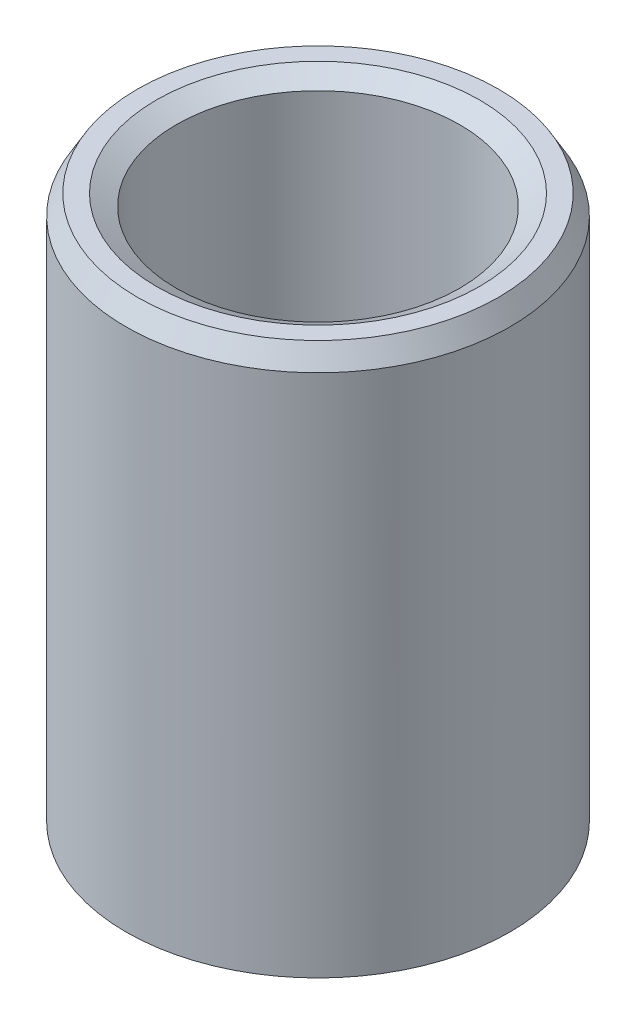
ISO-10303-21;
HEADER;
FILE_DESCRIPTION(('STEP AP214'),'2;1');
FILE_NAME('part.step','',(''),(''),'','','');
FILE_SCHEMA(('AUTOMOTIVE_DESIGN { 1 0 10303 214 1 1 1 1 }'));
ENDSEC;
DATA;
#1=APPLICATION_CONTEXT('core data for automotive mechanical design processes');
#2=APPLICATION_PROTOCOL_DEFINITION('international standard','automotive_design',2000,#1);
#3=PRODUCT_CONTEXT('',#1,'mechanical');
#4=PRODUCT('Part','Part','',(#3));
#5=PRODUCT_RELATED_PRODUCT_CATEGORY('part','',(#4));
#6=PRODUCT_DEFINITION_FORMATION('','',#4);
#7=PRODUCT_DEFINITION_CONTEXT('part definition',#1,'design');
#8=PRODUCT_DEFINITION('design','',#6,#7);
#9=PRODUCT_DEFINITION_SHAPE('','',#8);
#10=(LENGTH_UNIT() NAMED_UNIT(*) SI_UNIT(.MILLI.,.METRE.));
#11=(NAMED_UNIT(*) PLANE_ANGLE_UNIT() SI_UNIT($,.RADIAN.));
#12=(NAMED_UNIT(*) SI_UNIT($,.STERADIAN.) SOLID_ANGLE_UNIT());
#13=UNCERTAINTY_MEASURE_WITH_UNIT(LENGTH_MEASURE(1.E-05),#10,'distance_accuracy_value','');
#14=(GEOMETRIC_REPRESENTATION_CONTEXT(3) GLOBAL_UNCERTAINTY_ASSIGNED_CONTEXT((#13)) GLOBAL_UNIT_ASSIGNED_CONTEXT((#10,
#11,#12)) REPRESENTATION_CONTEXT('',''));
#15=CARTESIAN_POINT('',(0.,0.,0.));
#16=DIRECTION('',(0.,0.,1.));
#17=DIRECTION('',(1.,0.,0.));
#18=AXIS2_PLACEMENT_3D('',#15,#16,#17);
#19=CARTESIAN_POINT('',(0.,79.5900286234796,0.));
#20=DIRECTION('',(0.,-1.,0.));
#21=DIRECTION('',(0.,0.,-1.));
#22=AXIS2_PLACEMENT_3D('',#19,#20,#21);
#23=CYLINDRICAL_SURFACE('',#22,27.5);
#24=CARTESIAN_POINT('',(0.,1.64250513870305,0.));
#25=DIRECTION('',(0.,1.,0.));
#26=DIRECTION('',(0.,0.,1.));
#27=AXIS2_PLACEMENT_3D('',#24,#25,#26);
#28=CIRCLE('',#27,27.5);
#29=CARTESIAN_POINT('',(0.,1.64250513870305,27.5));
#30=VERTEX_POINT('',#29);
#31=EDGE_CURVE('E10',#30,#30,#28,.T.);
#32=ORIENTED_EDGE('',*,*,#31,.T.);
#33=EDGE_LOOP('',(#32));
#34=FACE_BOUND('',#33,.T.);
#35=CARTESIAN_POINT('',(0.,76.7451262715529,0.));
#36=DIRECTION('',(0.,1.,0.));
#37=DIRECTION('',(0.,0.,1.));
#38=AXIS2_PLACEMENT_3D('',#35,#36,#37);
#39=CIRCLE('',#38,27.5);
#40=CARTESIAN_POINT('',(0.,76.7451262715529,-27.5));
#41=VERTEX_POINT('',#40);
#42=EDGE_CURVE('E50',#41,#41,#39,.F.);
#43=ORIENTED_EDGE('',*,*,#42,.T.);
#44=EDGE_LOOP('',(#43));
#45=FACE_BOUND('',#44,.T.);
#46=ADVANCED_FACE('F39',(#34,#45),#23,.T.);
#47=CARTESIAN_POINT('',(0.,79.5900286234796,0.));
#48=DIRECTION('',(0.,1.,0.));
#49=DIRECTION('',(0.,0.,1.));
#50=AXIS2_PLACEMENT_3D('',#47,#48,#49);
#51=PLANE('',#50);
#52=CARTESIAN_POINT('',(0.,79.5900286234796,0.));
#53=DIRECTION('',(0.,1.,0.));
#54=DIRECTION('',(0.,0.,1.));
#55=AXIS2_PLACEMENT_3D('',#52,#53,#54);
#56=CIRCLE('',#55,23.1552551152172);
#57=CARTESIAN_POINT('',(0.,79.5900286234796,23.1552551152172));
#58=VERTEX_POINT('',#57);
#59=EDGE_CURVE('E58',#58,#58,#56,.F.);
#60=ORIENTED_EDGE('',*,*,#59,.T.);
#61=EDGE_LOOP('',(#60));
#62=FACE_BOUND('',#61,.T.);
#63=CARTESIAN_POINT('',(0.,79.5900286234796,0.));
#64=DIRECTION('',(0.,1.,0.));
#65=DIRECTION('',(0.,0.,1.));
#66=AXIS2_PLACEMENT_3D('',#63,#64,#65);
#67=CIRCLE('',#66,25.8574948612969);
#68=CARTESIAN_POINT('',(0.,79.5900286234796,-25.8574948612969));
#69=VERTEX_POINT('',#68);
#70=EDGE_CURVE('E61',#69,#69,#67,.T.);
#71=ORIENTED_EDGE('',*,*,#70,.T.);
#72=EDGE_LOOP('',(#71));
#73=FACE_BOUND('',#72,.T.);
#74=ADVANCED_FACE('F88',(#62,#73),#51,.T.);
#75=CARTESIAN_POINT('',(0.,0.,0.));
#76=DIRECTION('',(0.,1.,0.));
#77=DIRECTION('',(0.,0.,1.));
#78=AXIS2_PLACEMENT_3D('',#75,#76,#77);
#79=PLANE('',#78);
#80=CARTESIAN_POINT('',(0.,0.,0.));
#81=DIRECTION('',(0.,1.,0.));
#82=DIRECTION('',(0.,0.,1.));
#83=AXIS2_PLACEMENT_3D('',#80,#81,#82);
#84=CIRCLE('',#83,21.9528579019936);
#85=CARTESIAN_POINT('',(0.,0.,21.9528579019936));
#86=VERTEX_POINT('',#85);
#87=EDGE_CURVE('E51',#86,#86,#84,.T.);
#88=ORIENTED_EDGE('',*,*,#87,.T.);
#89=EDGE_LOOP('',(#88));
#90=FACE_BOUND('',#89,.T.);
#91=CARTESIAN_POINT('',(0.,0.,0.));
#92=DIRECTION('',(0.,1.,0.));
#93=DIRECTION('',(0.,0.,1.));
#94=AXIS2_PLACEMENT_3D('',#91,#92,#93);
#95=CIRCLE('',#94,24.6550976480733);
#96=CARTESIAN_POINT('',(0.,0.,24.6550976480733));
#97=VERTEX_POINT('',#96);
#98=EDGE_CURVE('E54',#97,#97,#95,.F.);
#99=ORIENTED_EDGE('',*,*,#98,.T.);
#100=EDGE_LOOP('',(#99));
#101=FACE_BOUND('',#100,.T.);
#102=ADVANCED_FACE('F83',(#90,#101),#79,.F.);
#103=CARTESIAN_POINT('',(0.,79.5900286234796,0.));
#104=DIRECTION('',(0.,-1.,0.));
#105=DIRECTION('',(0.,0.,-1.));
#106=AXIS2_PLACEMENT_3D('',#103,#104,#105);
#107=CYLINDRICAL_SURFACE('',#106,20.3103527632905);
#108=CARTESIAN_POINT('',(0.,77.9475234847766,0.));
#109=DIRECTION('',(0.,1.,0.));
#110=DIRECTION('',(0.,0.,1.));
#111=AXIS2_PLACEMENT_3D('',#108,#109,#110);
#112=CIRCLE('',#111,20.3103527632905);
#113=CARTESIAN_POINT('',(0.,77.9475234847766,20.3103527632905));
#114=VERTEX_POINT('',#113);
#115=EDGE_CURVE('E67',#114,#114,#112,.T.);
#116=ORIENTED_EDGE('',*,*,#115,.T.);
#117=EDGE_LOOP('',(#116));
#118=FACE_BOUND('',#117,.T.);
#119=CARTESIAN_POINT('',(0.,2.84490235192668,0.));
#120=DIRECTION('',(0.,1.,0.));
#121=DIRECTION('',(0.,0.,1.));
#122=AXIS2_PLACEMENT_3D('',#119,#120,#121);
#123=CIRCLE('',#122,20.3103527632905);
#124=CARTESIAN_POINT('',(0.,2.84490235192668,20.3103527632905));
#125=VERTEX_POINT('',#124);
#126=EDGE_CURVE('E69',#125,#125,#123,.F.);
#127=ORIENTED_EDGE('',*,*,#126,.T.);
#128=EDGE_LOOP('',(#127));
#129=FACE_BOUND('',#128,.T.);
#130=ADVANCED_FACE('F71',(#118,#129),#107,.F.);
#131=CARTESIAN_POINT('',(0.,77.9475234847766,0.));
#132=DIRECTION('',(0.,1.,0.));
#133=DIRECTION('',(0.,0.,1.));
#134=AXIS2_PLACEMENT_3D('',#131,#132,#133);
#135=CONICAL_SURFACE('',#134,20.3103527632905,1.0471975511966);
#136=CARTESIAN_POINT('',(0.,79.5900286234796,23.1552551152172));
#137=CARTESIAN_POINT('',(0.,79.5729191949515,23.1256207157179));
#138=CARTESIAN_POINT('',(0.,79.5558097664233,23.0959863162187));
#139=CARTESIAN_POINT('',(0.,79.521590909367,23.0367175172202));
#140=CARTESIAN_POINT('',(0.,79.5044814808388,23.007083117721));
#141=CARTESIAN_POINT('',(0.,79.4702626237825,22.9478143187225));
#142=CARTESIAN_POINT('',(0.,79.4531531952544,22.9181799192233));
#143=CARTESIAN_POINT('',(0.,79.4189343381981,22.8589111202248));
#144=CARTESIAN_POINT('',(0.,79.4018249096699,22.8292767207256));
#145=CARTESIAN_POINT('',(0.,79.3676060526136,22.7700079217271));
#146=CARTESIAN_POINT('',(0.,79.3504966240854,22.7403735222279));
#147=CARTESIAN_POINT('',(0.,79.3162777670291,22.6811047232294));
#148=CARTESIAN_POINT('',(0.,79.299168338501,22.6514703237302));
#149=CARTESIAN_POINT('',(0.,79.2649494814446,22.5922015247317));
#150=CARTESIAN_POINT('',(0.,79.2478400529165,22.5625671252324));
#151=CARTESIAN_POINT('',(0.,79.2136211958602,22.503298326234));
#152=CARTESIAN_POINT('',(0.,79.196511767332,22.4736639267347));
#153=CARTESIAN_POINT('',(0.,79.1622929102757,22.4143951277363));
#154=CARTESIAN_POINT('',(0.,79.1451834817476,22.384760728237));
#155=CARTESIAN_POINT('',(0.,79.1109646246912,22.3254919292386));
#156=CARTESIAN_POINT('',(0.,79.0938551961631,22.2958575297393));
#157=CARTESIAN_POINT('',(0.,79.0596363391068,22.2365887307409));
#158=CARTESIAN_POINT('',(0.,79.0425269105786,22.2069543312416));
#159=CARTESIAN_POINT('',(0.,79.0083080535223,22.1476855322431));
#160=CARTESIAN_POINT('',(0.,78.9911986249942,22.1180511327439));
#161=CARTESIAN_POINT('',(0.,78.9569797679378,22.0587823337454));
#162=CARTESIAN_POINT('',(0.,78.9398703394097,22.0291479342462));
#163=CARTESIAN_POINT('',(0.,78.9056514823534,21.9698791352477));
#164=CARTESIAN_POINT('',(0.,78.8885420538252,21.9402447357485));
#165=CARTESIAN_POINT('',(0.,78.8543231967689,21.88097593675));
#166=CARTESIAN_POINT('',(0.,78.8372137682407,21.8513415372508));
#167=CARTESIAN_POINT('',(0.,78.8029949111844,21.7920727382523));
#168=CARTESIAN_POINT('',(0.,78.7858854826563,21.7624383387531));
#169=CARTESIAN_POINT('',(0.,78.7516666255999,21.7031695397546));
#170=CARTESIAN_POINT('',(0.,78.7345571970718,21.6735351402554));
#171=CARTESIAN_POINT('',(0.,78.7003383400155,21.6142663412569));
#172=CARTESIAN_POINT('',(0.,78.6832289114873,21.5846319417577));
#173=CARTESIAN_POINT('',(0.,78.649010054431,21.5253631427592));
#174=CARTESIAN_POINT('',(0.,78.6319006259029,21.4957287432599));
#175=CARTESIAN_POINT('',(0.,78.5976817688465,21.4364599442615));
#176=CARTESIAN_POINT('',(0.,78.5805723403184,21.4068255447622));
#177=CARTESIAN_POINT('',(0.,78.5463534832621,21.3475567457638));
#178=CARTESIAN_POINT('',(0.,78.5292440547339,21.3179223462645));
#179=CARTESIAN_POINT('',(0.,78.4950251976776,21.2586535472661));
#180=CARTESIAN_POINT('',(0.,78.4779157691494,21.2290191477668));
#181=CARTESIAN_POINT('',(0.,78.4436969120931,21.1697503487684));
#182=CARTESIAN_POINT('',(0.,78.426587483565,21.1401159492691));
#183=CARTESIAN_POINT('',(0.,78.3923686265087,21.0808471502706));
#184=CARTESIAN_POINT('',(0.,78.3752591979805,21.0512127507714));
#185=CARTESIAN_POINT('',(0.,78.3410403409242,20.9919439517729));
#186=CARTESIAN_POINT('',(0.,78.323930912396,20.9623095522737));
#187=CARTESIAN_POINT('',(0.,78.2897120553397,20.9030407532752));
#188=CARTESIAN_POINT('',(0.,78.2726026268116,20.873406353776));
#189=CARTESIAN_POINT('',(0.,78.2383837697553,20.8141375547775));
#190=CARTESIAN_POINT('',(0.,78.2212743412271,20.7845031552783));
#191=CARTESIAN_POINT('',(0.,78.1870554841708,20.7252343562798));
#192=CARTESIAN_POINT('',(0.,78.1699460556426,20.6955999567806));
#193=CARTESIAN_POINT('',(0.,78.1357271985863,20.6363311577821));
#194=CARTESIAN_POINT('',(0.,78.1186177700582,20.6066967582829));
#195=CARTESIAN_POINT('',(0.,78.0843989130018,20.5474279592844));
#196=CARTESIAN_POINT('',(0.,78.0672894844737,20.5177935597852));
#197=CARTESIAN_POINT('',(0.,78.0330706274174,20.4585247607867));
#198=CARTESIAN_POINT('',(0.,78.0159611988892,20.4288903612875));
#199=CARTESIAN_POINT('',(0.,77.9817423418329,20.369621562289));
#200=CARTESIAN_POINT('',(0.,77.9646329133047,20.3399871627897));
#201=CARTESIAN_POINT('',(0.,77.9475234847766,20.3103527632905));
#202=B_SPLINE_CURVE_WITH_KNOTS('',3,(#136,#137,#138,#139,#140,#141,#142,#143,#144,#145,#146,
#147,#148,#149,#150,#151,#152,#153,#154,#155,#156,#157,#158,#159,#160,#161,#162,#163,#164,#165,
#166,#167,#168,#169,#170,#171,#172,#173,#174,#175,#176,#177,#178,#179,#180,#181,#182,#183,#184,
#185,#186,#187,#188,#189,#190,#191,#192,#193,#194,#195,#196,#197,#198,#199,#200,#201),
.UNSPECIFIED.,.F.,.F.,(4,2,2,2,2,2,2,2,2,2,2,2,2,2,2,2,2,2,2,2,2,2,2,2,2,2,2,2,2,2,2,2,4),(0.,
0.102656571168935,0.205313142337879,0.307969713506817,0.410626284675759,0.513282855844696,
0.615939427013641,0.718595998182579,0.821252569351523,0.923909140520465,1.0265657116894,
1.12922228285835,1.23187885402728,1.33453542519623,1.43719199636516,1.53984856753411,
1.64250513870305,1.74516170987199,1.84781828104093,1.95047485220987,2.05313142337881,
2.15578799454775,2.25844456571669,2.36110113688563,2.46375770805457,2.56641427922352,
2.66907085039246,2.7717274215614,2.87438399273034,2.97704056389928,3.07969713506822,
3.18235370623716,3.2850102774061),.UNSPECIFIED.);
#203=EDGE_CURVE('BSEAM77',#58,#114,#202,.T.);
#204=ORIENTED_EDGE('',*,*,#59,.F.);
#205=ORIENTED_EDGE('',*,*,#115,.F.);
#206=ORIENTED_EDGE('',*,*,#203,.T.);
#207=ORIENTED_EDGE('',*,*,#203,.F.);
#208=EDGE_LOOP('',(#204,#206,#205,#207));
#209=FACE_BOUND('',#208,.T.);
#210=ADVANCED_FACE('F77',(#209),#135,.F.);
#211=CARTESIAN_POINT('',(0.,0.,0.));
#212=DIRECTION('',(0.,-1.,0.));
#213=DIRECTION('',(0.,0.,-1.));
#214=AXIS2_PLACEMENT_3D('',#211,#212,#213);
#215=CONICAL_SURFACE('',#214,21.9528579019936,0.523598775598296);
#216=ORIENTED_EDGE('',*,*,#126,.F.);
#217=EDGE_LOOP('',(#216));
#218=FACE_BOUND('',#217,.T.);
#219=ORIENTED_EDGE('',*,*,#87,.F.);
#220=EDGE_LOOP('',(#219));
#221=FACE_BOUND('',#220,.T.);
#222=ADVANCED_FACE('F73',(#218,#221),#215,.F.);
#223=CARTESIAN_POINT('',(0.,1.64250513870305,0.));
#224=DIRECTION('',(0.,1.,0.));
#225=DIRECTION('',(0.,0.,1.));
#226=AXIS2_PLACEMENT_3D('',#223,#224,#225);
#227=CONICAL_SURFACE('',#226,27.5,1.0471975511966);
#228=ORIENTED_EDGE('',*,*,#98,.F.);
#229=EDGE_LOOP('',(#228));
#230=FACE_BOUND('',#229,.T.);
#231=ORIENTED_EDGE('',*,*,#31,.F.);
#232=EDGE_LOOP('',(#231));
#233=FACE_BOUND('',#232,.T.);
#234=ADVANCED_FACE('F76',(#230,#233),#227,.T.);
#235=CARTESIAN_POINT('',(0.,79.5900286234796,0.));
#236=DIRECTION('',(0.,-1.,0.));
#237=DIRECTION('',(0.,0.,-1.));
#238=AXIS2_PLACEMENT_3D('',#235,#236,#237);
#239=CONICAL_SURFACE('',#238,25.8574948612969,0.523598775598296);
#240=CARTESIAN_POINT('',(0.,76.7451262715529,-27.5));
#241=CARTESIAN_POINT('',(0.,76.7747606710521,-27.4828905714718));
#242=CARTESIAN_POINT('',(0.,76.8043950705514,-27.4657811429437));
#243=CARTESIAN_POINT('',(0.,76.8636638695499,-27.4315622858874));
#244=CARTESIAN_POINT('',(0.,76.8932982690491,-27.4144528573592));
#245=CARTESIAN_POINT('',(0.,76.9525670680476,-27.3802340003029));
#246=CARTESIAN_POINT('',(0.,76.9822014675468,-27.3631245717747));
#247=CARTESIAN_POINT('',(0.,77.0414702665453,-27.3289057147184));
#248=CARTESIAN_POINT('',(0.,77.0711046660445,-27.3117962861903));
#249=CARTESIAN_POINT('',(0.,77.130373465043,-27.277577429134));
#250=CARTESIAN_POINT('',(0.,77.1600078645422,-27.2604680006058));
#251=CARTESIAN_POINT('',(0.,77.2192766635407,-27.2262491435495));
#252=CARTESIAN_POINT('',(0.,77.2489110630399,-27.2091397150213));
#253=CARTESIAN_POINT('',(0.,77.3081798620384,-27.174920857965));
#254=CARTESIAN_POINT('',(0.,77.3378142615376,-27.1578114294369));
#255=CARTESIAN_POINT('',(0.,77.3970830605361,-27.1235925723805));
#256=CARTESIAN_POINT('',(0.,77.4267174600353,-27.1064831438524));
#257=CARTESIAN_POINT('',(0.,77.4859862590338,-27.0722642867961));
#258=CARTESIAN_POINT('',(0.,77.5156206585331,-27.0551548582679));
#259=CARTESIAN_POINT('',(0.,77.5748894575315,-27.0209360012116));
#260=CARTESIAN_POINT('',(0.,77.6045238570308,-27.0038265726834));
#261=CARTESIAN_POINT('',(0.,77.6637926560292,-26.9696077156271));
#262=CARTESIAN_POINT('',(0.,77.6934270555285,-26.952498287099));
#263=CARTESIAN_POINT('',(0.,77.7526958545269,-26.9182794300427));
#264=CARTESIAN_POINT('',(0.,77.7823302540262,-26.9011700015145));
#265=CARTESIAN_POINT('',(0.,77.8415990530247,-26.8669511444582));
#266=CARTESIAN_POINT('',(0.,77.8712334525239,-26.84984171593));
#267=CARTESIAN_POINT('',(0.,77.9305022515224,-26.8156228588737));
#268=CARTESIAN_POINT('',(0.,77.9601366510216,-26.7985134303456));
#269=CARTESIAN_POINT('',(0.,78.0194054500201,-26.7642945732892));
#270=CARTESIAN_POINT('',(0.,78.0490398495193,-26.7471851447611));
#271=CARTESIAN_POINT('',(0.,78.1083086485178,-26.7129662877048));
#272=CARTESIAN_POINT('',(0.,78.137943048017,-26.6958568591766));
#273=CARTESIAN_POINT('',(0.,78.1972118470155,-26.6616380021203));
#274=CARTESIAN_POINT('',(0.,78.2268462465147,-26.6445285735921));
#275=CARTESIAN_POINT('',(0.,78.2861150455132,-26.6103097165358));
#276=CARTESIAN_POINT('',(0.,78.3157494450124,-26.5932002880077));
#277=CARTESIAN_POINT('',(0.,78.3750182440109,-26.5589814309514));
#278=CARTESIAN_POINT('',(0.,78.4046526435101,-26.5418720024232));
#279=CARTESIAN_POINT('',(0.,78.4639214425086,-26.5076531453669));
#280=CARTESIAN_POINT('',(0.,78.4935558420079,-26.4905437168387));
#281=CARTESIAN_POINT('',(0.,78.5528246410063,-26.4563248597824));
#282=CARTESIAN_POINT('',(0.,78.5824590405056,-26.4392154312543));
#283=CARTESIAN_POINT('',(0.,78.6417278395041,-26.4049965741979));
#284=CARTESIAN_POINT('',(0.,78.6713622390033,-26.3878871456698));
#285=CARTESIAN_POINT('',(0.,78.7306310380018,-26.3536682886135));
#286=CARTESIAN_POINT('',(0.,78.760265437501,-26.3365588600853));
#287=CARTESIAN_POINT('',(0.,78.8195342364995,-26.302340003029));
#288=CARTESIAN_POINT('',(0.,78.8491686359987,-26.2852305745008));
#289=CARTESIAN_POINT('',(0.,78.9084374349972,-26.2510117174445));
#290=CARTESIAN_POINT('',(0.,78.9380718344964,-26.2339022889164));
#291=CARTESIAN_POINT('',(0.,78.9973406334949,-26.1996834318601));
#292=CARTESIAN_POINT('',(0.,79.0269750329941,-26.1825740033319));
#293=CARTESIAN_POINT('',(0.,79.0862438319926,-26.1483551462756));
#294=CARTESIAN_POINT('',(0.,79.1158782314918,-26.1312457177474));
#295=CARTESIAN_POINT('',(0.,79.1751470304903,-26.0970268606911));
#296=CARTESIAN_POINT('',(0.,79.2047814299896,-26.079917432163));
#297=CARTESIAN_POINT('',(0.,79.264050228988,-26.0456985751066));
#298=CARTESIAN_POINT('',(0.,79.2936846284873,-26.0285891465785));
#299=CARTESIAN_POINT('',(0.,79.3529534274857,-25.9943702895222));
#300=CARTESIAN_POINT('',(0.,79.382587826985,-25.977260860994));
#301=CARTESIAN_POINT('',(0.,79.4418566259834,-25.9430420039377));
#302=CARTESIAN_POINT('',(0.,79.4714910254827,-25.9259325754095));
#303=CARTESIAN_POINT('',(0.,79.5307598244812,-25.8917137183532));
#304=CARTESIAN_POINT('',(0.,79.5603942239804,-25.8746042898251));
#305=CARTESIAN_POINT('',(0.,79.5900286234796,-25.8574948612969));
#306=B_SPLINE_CURVE_WITH_KNOTS('',3,(#240,#241,#242,#243,#244,#245,#246,#247,#248,#249,#250,
#251,#252,#253,#254,#255,#256,#257,#258,#259,#260,#261,#262,#263,#264,#265,#266,#267,#268,#269,
#270,#271,#272,#273,#274,#275,#276,#277,#278,#279,#280,#281,#282,#283,#284,#285,#286,#287,#288,
#289,#290,#291,#292,#293,#294,#295,#296,#297,#298,#299,#300,#301,#302,#303,#304,#305),
.UNSPECIFIED.,.F.,.F.,(4,2,2,2,2,2,2,2,2,2,2,2,2,2,2,2,2,2,2,2,2,2,2,2,2,2,2,2,2,2,2,2,4),(0.,
0.102656571168938,0.205313142337878,0.30796971350683,0.41062628467577,0.513282855844708,
0.61593942701366,0.7185959981826,0.82125256935154,0.92390914052049,1.02656571168943,
1.12922228285837,1.23187885402732,1.33453542519626,1.4371919963652,1.53984856753415,
1.64250513870309,1.74516170987203,1.84781828104098,1.95047485220992,2.05313142337886,
2.15578799454781,2.25844456571675,2.36110113688569,2.46375770805464,2.56641427922358,
2.66907085039252,2.77172742156147,2.87438399273041,2.97704056389935,3.0796971350683,
3.18235370623724,3.28501027740619),.UNSPECIFIED.);
#307=EDGE_CURVE('BSEAM45',#41,#69,#306,.T.);
#308=ORIENTED_EDGE('',*,*,#42,.F.);
#309=ORIENTED_EDGE('',*,*,#70,.F.);
#310=ORIENTED_EDGE('',*,*,#307,.T.);
#311=ORIENTED_EDGE('',*,*,#307,.F.);
#312=EDGE_LOOP('',(#308,#310,#309,#311));
#313=FACE_BOUND('',#312,.T.);
#314=ADVANCED_FACE('F45',(#313),#239,.T.);
#315=CLOSED_SHELL('',(#46,#74,#102,#130,#210,#222,#234,#314));
#316=MANIFOLD_SOLID_BREP('B2',#315);
#317=ADVANCED_BREP_SHAPE_REPRESENTATION('',(#18,#316),#14);
#318=SHAPE_DEFINITION_REPRESENTATION(#9,#317);
ENDSEC;
END-ISO-10303-21;
